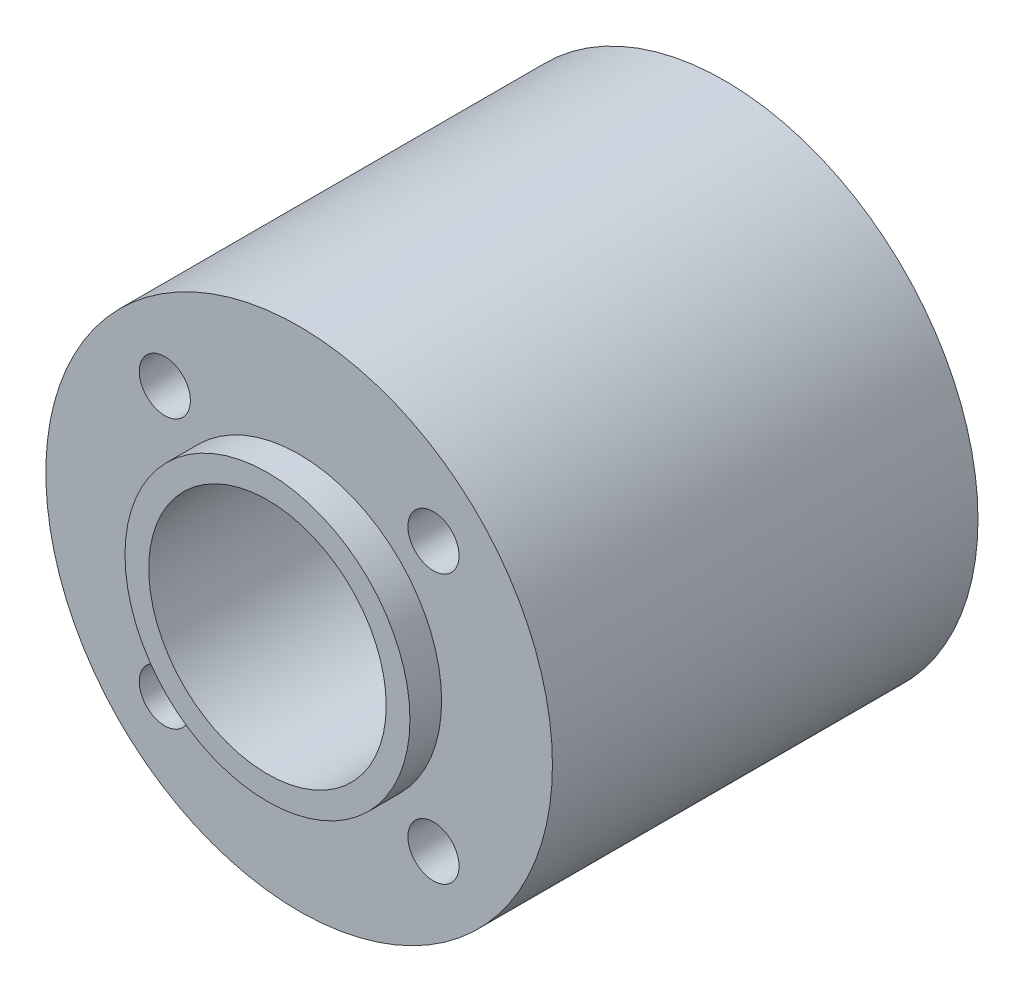
ISO-10303-21;
HEADER;
FILE_DESCRIPTION(('STEP AP214'),'2;1');
FILE_NAME('part.step','',(''),(''),'','','');
FILE_SCHEMA(('AUTOMOTIVE_DESIGN { 1 0 10303 214 1 1 1 1 }'));
ENDSEC;
DATA;
#1=APPLICATION_CONTEXT('core data for automotive mechanical design processes');
#2=APPLICATION_PROTOCOL_DEFINITION('international standard','automotive_design',2000,#1);
#3=PRODUCT_CONTEXT('',#1,'mechanical');
#4=PRODUCT('Part','Part','',(#3));
#5=PRODUCT_RELATED_PRODUCT_CATEGORY('part','',(#4));
#6=PRODUCT_DEFINITION_FORMATION('','',#4);
#7=PRODUCT_DEFINITION_CONTEXT('part definition',#1,'design');
#8=PRODUCT_DEFINITION('design','',#6,#7);
#9=PRODUCT_DEFINITION_SHAPE('','',#8);
#10=(LENGTH_UNIT() NAMED_UNIT(*) SI_UNIT(.MILLI.,.METRE.));
#11=(NAMED_UNIT(*) PLANE_ANGLE_UNIT() SI_UNIT($,.RADIAN.));
#12=(NAMED_UNIT(*) SI_UNIT($,.STERADIAN.) SOLID_ANGLE_UNIT());
#13=UNCERTAINTY_MEASURE_WITH_UNIT(LENGTH_MEASURE(1.E-05),#10,'distance_accuracy_value','');
#14=(GEOMETRIC_REPRESENTATION_CONTEXT(3) GLOBAL_UNCERTAINTY_ASSIGNED_CONTEXT((#13)) GLOBAL_UNIT_ASSIGNED_CONTEXT((#10,
#11,#12)) REPRESENTATION_CONTEXT('',''));
#15=CARTESIAN_POINT('',(0.,0.,0.));
#16=DIRECTION('',(0.,0.,1.));
#17=DIRECTION('',(1.,0.,0.));
#18=AXIS2_PLACEMENT_3D('',#15,#16,#17);
#19=CARTESIAN_POINT('',(0.,0.,26.88));
#20=DIRECTION('',(0.,0.,-1.));
#21=DIRECTION('',(-1.,0.,0.));
#22=AXIS2_PLACEMENT_3D('',#19,#20,#21);
#23=CYLINDRICAL_SURFACE('',#22,16.);
#24=CARTESIAN_POINT('',(0.,0.,26.88));
#25=DIRECTION('',(0.,0.,1.));
#26=DIRECTION('',(1.,0.,0.));
#27=AXIS2_PLACEMENT_3D('',#24,#25,#26);
#28=CIRCLE('',#27,16.);
#29=CARTESIAN_POINT('',(16.,0.,26.88));
#30=VERTEX_POINT('',#29);
#31=EDGE_CURVE('E46',#30,#30,#28,.T.);
#32=ORIENTED_EDGE('',*,*,#31,.F.);
#33=EDGE_LOOP('',(#32));
#34=FACE_BOUND('',#33,.T.);
#35=CARTESIAN_POINT('',(0.,0.,0.));
#36=DIRECTION('',(0.,0.,1.));
#37=DIRECTION('',(1.,0.,0.));
#38=AXIS2_PLACEMENT_3D('',#35,#36,#37);
#39=CIRCLE('',#38,16.);
#40=CARTESIAN_POINT('',(16.,0.,0.));
#41=VERTEX_POINT('',#40);
#42=EDGE_CURVE('E54',#41,#41,#39,.T.);
#43=ORIENTED_EDGE('',*,*,#42,.T.);
#44=EDGE_LOOP('',(#43));
#45=FACE_BOUND('',#44,.T.);
#46=ADVANCED_FACE('F34',(#34,#45),#23,.T.);
#47=CARTESIAN_POINT('',(0.,0.,26.88));
#48=DIRECTION('',(0.,0.,1.));
#49=DIRECTION('',(1.,0.,0.));
#50=AXIS2_PLACEMENT_3D('',#47,#48,#49);
#51=PLANE('',#50);
#52=CARTESIAN_POINT('',(-8.48499999999961,-8.485,26.88));
#53=DIRECTION('',(0.,0.,1.));
#54=DIRECTION('',(1.,0.,0.));
#55=AXIS2_PLACEMENT_3D('',#52,#53,#54);
#56=CIRCLE('',#55,1.61500000000025);
#57=CARTESIAN_POINT('',(-6.86999999999936,-8.485,26.88));
#58=VERTEX_POINT('',#57);
#59=EDGE_CURVE('E84',#58,#58,#56,.T.);
#60=ORIENTED_EDGE('',*,*,#59,.F.);
#61=EDGE_LOOP('',(#60));
#62=FACE_BOUND('',#61,.T.);
#63=CARTESIAN_POINT('',(8.48500000000047,-8.48499999999961,26.88));
#64=DIRECTION('',(0.,0.,1.));
#65=DIRECTION('',(1.,0.,0.));
#66=AXIS2_PLACEMENT_3D('',#63,#64,#65);
#67=CIRCLE('',#66,1.61500000000066);
#68=CARTESIAN_POINT('',(10.1000000000011,-8.48499999999961,26.88));
#69=VERTEX_POINT('',#68);
#70=EDGE_CURVE('E87',#69,#69,#67,.T.);
#71=ORIENTED_EDGE('',*,*,#70,.F.);
#72=EDGE_LOOP('',(#71));
#73=FACE_BOUND('',#72,.T.);
#74=CARTESIAN_POINT('',(8.48500000000009,8.48500000000047,26.88));
#75=DIRECTION('',(0.,0.,1.));
#76=DIRECTION('',(1.,0.,0.));
#77=AXIS2_PLACEMENT_3D('',#74,#75,#76);
#78=CIRCLE('',#77,1.61500000000049);
#79=CARTESIAN_POINT('',(10.1000000000006,8.48500000000047,26.88));
#80=VERTEX_POINT('',#79);
#81=EDGE_CURVE('E83',#80,#80,#78,.T.);
#82=ORIENTED_EDGE('',*,*,#81,.F.);
#83=EDGE_LOOP('',(#82));
#84=FACE_BOUND('',#83,.T.);
#85=CARTESIAN_POINT('',(-8.485,8.48500000000009,26.88));
#86=DIRECTION('',(0.,0.,1.));
#87=DIRECTION('',(1.,0.,0.));
#88=AXIS2_PLACEMENT_3D('',#85,#86,#87);
#89=CIRCLE('',#88,1.615);
#90=CARTESIAN_POINT('',(-6.87,8.48500000000009,26.88));
#91=VERTEX_POINT('',#90);
#92=EDGE_CURVE('E64',#91,#91,#89,.T.);
#93=ORIENTED_EDGE('',*,*,#92,.F.);
#94=EDGE_LOOP('',(#93));
#95=FACE_BOUND('',#94,.T.);
#96=CARTESIAN_POINT('',(0.,0.,26.88));
#97=DIRECTION('',(0.,0.,1.));
#98=DIRECTION('',(1.,0.,0.));
#99=AXIS2_PLACEMENT_3D('',#96,#97,#98);
#100=CIRCLE('',#99,9.);
#101=CARTESIAN_POINT('',(9.,0.,26.88));
#102=VERTEX_POINT('',#101);
#103=EDGE_CURVE('E41',#102,#102,#100,.T.);
#104=ORIENTED_EDGE('',*,*,#103,.F.);
#105=EDGE_LOOP('',(#104));
#106=FACE_BOUND('',#105,.T.);
#107=ORIENTED_EDGE('',*,*,#31,.T.);
#108=EDGE_LOOP('',(#107));
#109=FACE_BOUND('',#108,.T.);
#110=ADVANCED_FACE('F96',(#62,#73,#84,#95,#106,#109),#51,.T.);
#111=CARTESIAN_POINT('',(0.,0.,0.));
#112=DIRECTION('',(0.,0.,1.));
#113=DIRECTION('',(1.,0.,0.));
#114=AXIS2_PLACEMENT_3D('',#111,#112,#113);
#115=PLANE('',#114);
#116=CARTESIAN_POINT('',(-8.48499999999961,-8.485,0.));
#117=DIRECTION('',(0.,0.,1.));
#118=DIRECTION('',(1.,0.,0.));
#119=AXIS2_PLACEMENT_3D('',#116,#117,#118);
#120=CIRCLE('',#119,1.61500000000025);
#121=CARTESIAN_POINT('',(-6.86999999999936,-8.485,0.));
#122=VERTEX_POINT('',#121);
#123=EDGE_CURVE('E37',#122,#122,#120,.T.);
#124=ORIENTED_EDGE('',*,*,#123,.T.);
#125=EDGE_LOOP('',(#124));
#126=FACE_BOUND('',#125,.T.);
#127=CARTESIAN_POINT('',(8.48500000000047,-8.48499999999961,0.));
#128=DIRECTION('',(0.,0.,1.));
#129=DIRECTION('',(1.,0.,0.));
#130=AXIS2_PLACEMENT_3D('',#127,#128,#129);
#131=CIRCLE('',#130,1.61500000000066);
#132=CARTESIAN_POINT('',(10.1000000000011,-8.48499999999961,0.));
#133=VERTEX_POINT('',#132);
#134=EDGE_CURVE('E66',#133,#133,#131,.T.);
#135=ORIENTED_EDGE('',*,*,#134,.T.);
#136=EDGE_LOOP('',(#135));
#137=FACE_BOUND('',#136,.T.);
#138=CARTESIAN_POINT('',(8.48500000000009,8.48500000000047,0.));
#139=DIRECTION('',(0.,0.,1.));
#140=DIRECTION('',(1.,0.,0.));
#141=AXIS2_PLACEMENT_3D('',#138,#139,#140);
#142=CIRCLE('',#141,1.61500000000049);
#143=CARTESIAN_POINT('',(10.1000000000006,8.48500000000047,0.));
#144=VERTEX_POINT('',#143);
#145=EDGE_CURVE('E63',#144,#144,#142,.T.);
#146=ORIENTED_EDGE('',*,*,#145,.T.);
#147=EDGE_LOOP('',(#146));
#148=FACE_BOUND('',#147,.T.);
#149=CARTESIAN_POINT('',(-8.485,8.48500000000009,0.));
#150=DIRECTION('',(0.,0.,1.));
#151=DIRECTION('',(1.,0.,0.));
#152=AXIS2_PLACEMENT_3D('',#149,#150,#151);
#153=CIRCLE('',#152,1.615);
#154=CARTESIAN_POINT('',(-6.87,8.48500000000009,0.));
#155=VERTEX_POINT('',#154);
#156=EDGE_CURVE('E60',#155,#155,#153,.T.);
#157=ORIENTED_EDGE('',*,*,#156,.T.);
#158=EDGE_LOOP('',(#157));
#159=FACE_BOUND('',#158,.T.);
#160=CARTESIAN_POINT('',(0.,0.,0.));
#161=DIRECTION('',(0.,0.,-1.));
#162=DIRECTION('',(-1.,0.,0.));
#163=AXIS2_PLACEMENT_3D('',#160,#161,#162);
#164=CIRCLE('',#163,9.);
#165=CARTESIAN_POINT('',(-9.,0.,0.));
#166=VERTEX_POINT('',#165);
#167=EDGE_CURVE('E10',#166,#166,#164,.T.);
#168=ORIENTED_EDGE('',*,*,#167,.F.);
#169=EDGE_LOOP('',(#168));
#170=FACE_BOUND('',#169,.T.);
#171=ORIENTED_EDGE('',*,*,#42,.F.);
#172=EDGE_LOOP('',(#171));
#173=FACE_BOUND('',#172,.T.);
#174=ADVANCED_FACE('F99',(#126,#137,#148,#159,#170,#173),#115,.F.);
#175=CARTESIAN_POINT('',(0.,0.,28.88));
#176=DIRECTION('',(0.,0.,-1.));
#177=DIRECTION('',(-1.,0.,0.));
#178=AXIS2_PLACEMENT_3D('',#175,#176,#177);
#179=CYLINDRICAL_SURFACE('',#178,9.);
#180=CARTESIAN_POINT('',(0.,0.,28.88));
#181=DIRECTION('',(0.,0.,1.));
#182=DIRECTION('',(1.,0.,0.));
#183=AXIS2_PLACEMENT_3D('',#180,#181,#182);
#184=CIRCLE('',#183,9.);
#185=CARTESIAN_POINT('',(9.,0.,28.88));
#186=VERTEX_POINT('',#185);
#187=EDGE_CURVE('E52',#186,#186,#184,.T.);
#188=ORIENTED_EDGE('',*,*,#187,.F.);
#189=EDGE_LOOP('',(#188));
#190=FACE_BOUND('',#189,.T.);
#191=ORIENTED_EDGE('',*,*,#103,.T.);
#192=EDGE_LOOP('',(#191));
#193=FACE_BOUND('',#192,.T.);
#194=ADVANCED_FACE('F113',(#190,#193),#179,.T.);
#195=CARTESIAN_POINT('',(0.,0.,28.88));
#196=DIRECTION('',(0.,0.,1.));
#197=DIRECTION('',(1.,0.,0.));
#198=AXIS2_PLACEMENT_3D('',#195,#196,#197);
#199=PLANE('',#198);
#200=CARTESIAN_POINT('',(0.,0.,28.88));
#201=DIRECTION('',(0.,0.,1.));
#202=DIRECTION('',(1.,0.,0.));
#203=AXIS2_PLACEMENT_3D('',#200,#201,#202);
#204=CIRCLE('',#203,7.5);
#205=CARTESIAN_POINT('',(7.5,0.,28.88));
#206=VERTEX_POINT('',#205);
#207=EDGE_CURVE('E71',#206,#206,#204,.T.);
#208=ORIENTED_EDGE('',*,*,#207,.F.);
#209=EDGE_LOOP('',(#208));
#210=FACE_BOUND('',#209,.T.);
#211=ORIENTED_EDGE('',*,*,#187,.T.);
#212=EDGE_LOOP('',(#211));
#213=FACE_BOUND('',#212,.T.);
#214=ADVANCED_FACE('F117',(#210,#213),#199,.T.);
#215=CARTESIAN_POINT('',(0.,0.,-2.));
#216=DIRECTION('',(0.,0.,1.));
#217=DIRECTION('',(1.,0.,0.));
#218=AXIS2_PLACEMENT_3D('',#215,#216,#217);
#219=CYLINDRICAL_SURFACE('',#218,9.);
#220=CARTESIAN_POINT('',(0.,0.,-2.));
#221=DIRECTION('',(0.,0.,-1.));
#222=DIRECTION('',(-1.,0.,0.));
#223=AXIS2_PLACEMENT_3D('',#220,#221,#222);
#224=CIRCLE('',#223,9.);
#225=CARTESIAN_POINT('',(-9.,0.,-2.));
#226=VERTEX_POINT('',#225);
#227=EDGE_CURVE('E50',#226,#226,#224,.T.);
#228=ORIENTED_EDGE('',*,*,#227,.F.);
#229=EDGE_LOOP('',(#228));
#230=FACE_BOUND('',#229,.T.);
#231=ORIENTED_EDGE('',*,*,#167,.T.);
#232=EDGE_LOOP('',(#231));
#233=FACE_BOUND('',#232,.T.);
#234=ADVANCED_FACE('F123',(#230,#233),#219,.T.);
#235=CARTESIAN_POINT('',(0.,0.,-2.));
#236=DIRECTION('',(0.,0.,-1.));
#237=DIRECTION('',(-1.,0.,0.));
#238=AXIS2_PLACEMENT_3D('',#235,#236,#237);
#239=PLANE('',#238);
#240=CARTESIAN_POINT('',(0.,0.,-2.));
#241=DIRECTION('',(0.,0.,1.));
#242=DIRECTION('',(1.,0.,0.));
#243=AXIS2_PLACEMENT_3D('',#240,#241,#242);
#244=CIRCLE('',#243,7.5);
#245=CARTESIAN_POINT('',(7.5,0.,-2.));
#246=VERTEX_POINT('',#245);
#247=EDGE_CURVE('E75',#246,#246,#244,.T.);
#248=ORIENTED_EDGE('',*,*,#247,.T.);
#249=EDGE_LOOP('',(#248));
#250=FACE_BOUND('',#249,.T.);
#251=ORIENTED_EDGE('',*,*,#227,.T.);
#252=EDGE_LOOP('',(#251));
#253=FACE_BOUND('',#252,.T.);
#254=ADVANCED_FACE('F127',(#250,#253),#239,.T.);
#255=CARTESIAN_POINT('',(0.,0.,-2.));
#256=DIRECTION('',(0.,0.,1.));
#257=DIRECTION('',(1.,0.,0.));
#258=AXIS2_PLACEMENT_3D('',#255,#256,#257);
#259=CYLINDRICAL_SURFACE('',#258,7.5);
#260=ORIENTED_EDGE('',*,*,#247,.F.);
#261=EDGE_LOOP('',(#260));
#262=FACE_BOUND('',#261,.T.);
#263=ORIENTED_EDGE('',*,*,#207,.T.);
#264=EDGE_LOOP('',(#263));
#265=FACE_BOUND('',#264,.T.);
#266=ADVANCED_FACE('F131',(#262,#265),#259,.F.);
#267=CARTESIAN_POINT('',(-8.485,8.48500000000009,-2.));
#268=DIRECTION('',(0.,0.,1.));
#269=DIRECTION('',(1.,0.,0.));
#270=AXIS2_PLACEMENT_3D('',#267,#268,#269);
#271=CYLINDRICAL_SURFACE('',#270,1.615);
#272=ORIENTED_EDGE('',*,*,#92,.T.);
#273=EDGE_LOOP('',(#272));
#274=FACE_BOUND('',#273,.T.);
#275=ORIENTED_EDGE('',*,*,#156,.F.);
#276=EDGE_LOOP('',(#275));
#277=FACE_BOUND('',#276,.T.);
#278=ADVANCED_FACE('F135',(#274,#277),#271,.F.);
#279=CARTESIAN_POINT('',(8.48500000000009,8.48500000000047,-2.));
#280=DIRECTION('',(0.,0.,1.));
#281=DIRECTION('',(1.,0.,0.));
#282=AXIS2_PLACEMENT_3D('',#279,#280,#281);
#283=CYLINDRICAL_SURFACE('',#282,1.61500000000049);
#284=ORIENTED_EDGE('',*,*,#81,.T.);
#285=EDGE_LOOP('',(#284));
#286=FACE_BOUND('',#285,.T.);
#287=ORIENTED_EDGE('',*,*,#145,.F.);
#288=EDGE_LOOP('',(#287));
#289=FACE_BOUND('',#288,.T.);
#290=ADVANCED_FACE('F93',(#286,#289),#283,.F.);
#291=CARTESIAN_POINT('',(8.48500000000047,-8.48499999999961,-2.));
#292=DIRECTION('',(0.,0.,1.));
#293=DIRECTION('',(1.,0.,0.));
#294=AXIS2_PLACEMENT_3D('',#291,#292,#293);
#295=CYLINDRICAL_SURFACE('',#294,1.61500000000066);
#296=ORIENTED_EDGE('',*,*,#70,.T.);
#297=EDGE_LOOP('',(#296));
#298=FACE_BOUND('',#297,.T.);
#299=ORIENTED_EDGE('',*,*,#134,.F.);
#300=EDGE_LOOP('',(#299));
#301=FACE_BOUND('',#300,.T.);
#302=ADVANCED_FACE('F143',(#298,#301),#295,.F.);
#303=CARTESIAN_POINT('',(-8.48499999999961,-8.485,-2.));
#304=DIRECTION('',(0.,0.,1.));
#305=DIRECTION('',(1.,0.,0.));
#306=AXIS2_PLACEMENT_3D('',#303,#304,#305);
#307=CYLINDRICAL_SURFACE('',#306,1.61500000000025);
#308=ORIENTED_EDGE('',*,*,#59,.T.);
#309=EDGE_LOOP('',(#308));
#310=FACE_BOUND('',#309,.T.);
#311=ORIENTED_EDGE('',*,*,#123,.F.);
#312=EDGE_LOOP('',(#311));
#313=FACE_BOUND('',#312,.T.);
#314=ADVANCED_FACE('F140',(#310,#313),#307,.F.);
#315=CLOSED_SHELL('',(#46,#110,#174,#194,#214,#234,#254,#266,#278,#290,#302,#314));
#316=MANIFOLD_SOLID_BREP('B2',#315);
#317=ADVANCED_BREP_SHAPE_REPRESENTATION('',(#18,#316),#14);
#318=SHAPE_DEFINITION_REPRESENTATION(#9,#317);
ENDSEC;
END-ISO-10303-21;
